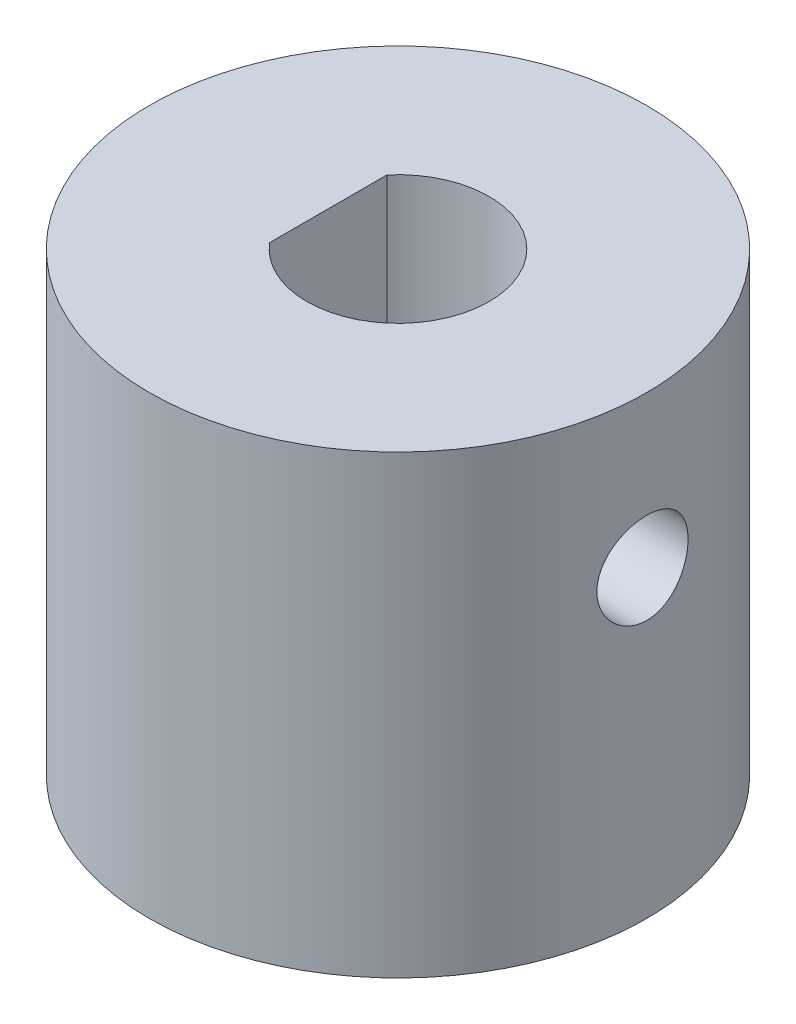
ISO-10303-21;
HEADER;
FILE_DESCRIPTION(('STEP AP214'),'2;1');
FILE_NAME('part.step','',(''),(''),'','','');
FILE_SCHEMA(('AUTOMOTIVE_DESIGN { 1 0 10303 214 1 1 1 1 }'));
ENDSEC;
DATA;
#1=APPLICATION_CONTEXT('core data for automotive mechanical design processes');
#2=APPLICATION_PROTOCOL_DEFINITION('international standard','automotive_design',2000,#1);
#3=PRODUCT_CONTEXT('',#1,'mechanical');
#4=PRODUCT('Part','Part','',(#3));
#5=PRODUCT_RELATED_PRODUCT_CATEGORY('part','',(#4));
#6=PRODUCT_DEFINITION_FORMATION('','',#4);
#7=PRODUCT_DEFINITION_CONTEXT('part definition',#1,'design');
#8=PRODUCT_DEFINITION('design','',#6,#7);
#9=PRODUCT_DEFINITION_SHAPE('','',#8);
#10=(LENGTH_UNIT() NAMED_UNIT(*) SI_UNIT(.MILLI.,.METRE.));
#11=(NAMED_UNIT(*) PLANE_ANGLE_UNIT() SI_UNIT($,.RADIAN.));
#12=(NAMED_UNIT(*) SI_UNIT($,.STERADIAN.) SOLID_ANGLE_UNIT());
#13=UNCERTAINTY_MEASURE_WITH_UNIT(LENGTH_MEASURE(1.E-05),#10,'distance_accuracy_value','');
#14=(GEOMETRIC_REPRESENTATION_CONTEXT(3) GLOBAL_UNCERTAINTY_ASSIGNED_CONTEXT((#13)) GLOBAL_UNIT_ASSIGNED_CONTEXT((#10,
#11,#12)) REPRESENTATION_CONTEXT('',''));
#15=CARTESIAN_POINT('',(0.,0.,0.));
#16=DIRECTION('',(0.,0.,1.));
#17=DIRECTION('',(1.,0.,0.));
#18=AXIS2_PLACEMENT_3D('',#15,#16,#17);
#19=CARTESIAN_POINT('',(0.,15.,0.));
#20=DIRECTION('',(0.,-1.,0.));
#21=DIRECTION('',(0.,0.,-1.));
#22=AXIS2_PLACEMENT_3D('',#19,#20,#21);
#23=CYLINDRICAL_SURFACE('',#22,8.1890069126629);
#24=CARTESIAN_POINT('',(0.,15.,0.));
#25=DIRECTION('',(0.,1.,0.));
#26=DIRECTION('',(0.,0.,1.));
#27=AXIS2_PLACEMENT_3D('',#24,#25,#26);
#28=CIRCLE('',#27,8.1890069126629);
#29=CARTESIAN_POINT('',(0.,15.,8.1890069126629));
#30=VERTEX_POINT('',#29);
#31=EDGE_CURVE('E93',#30,#30,#28,.T.);
#32=ORIENTED_EDGE('',*,*,#31,.F.);
#33=EDGE_LOOP('',(#32));
#34=FACE_BOUND('',#33,.T.);
#35=CARTESIAN_POINT('',(0.,0.,0.));
#36=DIRECTION('',(0.,1.,0.));
#37=DIRECTION('',(0.,0.,1.));
#38=AXIS2_PLACEMENT_3D('',#35,#36,#37);
#39=CIRCLE('',#38,8.1890069126629);
#40=CARTESIAN_POINT('',(0.,0.,8.1890069126629));
#41=VERTEX_POINT('',#40);
#42=EDGE_CURVE('E97',#41,#41,#39,.T.);
#43=ORIENTED_EDGE('',*,*,#42,.T.);
#44=EDGE_LOOP('',(#43));
#45=FACE_BOUND('',#44,.T.);
#46=CARTESIAN_POINT('',(-8.05045552845556,10.,1.5));
#47=CARTESIAN_POINT('',(-8.05045712508259,10.0834938156143,1.4999967617717));
#48=CARTESIAN_POINT('',(-8.05176853870894,10.1670300636327,1.49300513990406));
#49=CARTESIAN_POINT('',(-8.05686634931734,10.3317495697272,1.4652407751053));
#50=CARTESIAN_POINT('',(-8.06065488543688,10.4129307307125,1.44445612086685));
#51=CARTESIAN_POINT('',(-8.07026379045823,10.5705327738723,1.38976326790009));
#52=CARTESIAN_POINT('',(-8.07608230855931,10.6469579177234,1.3558670203884));
#53=CARTESIAN_POINT('',(-8.08909338794624,10.7930311217619,1.27594444054268));
#54=CARTESIAN_POINT('',(-8.09628583178107,10.862679760476,1.22991914494129));
#55=CARTESIAN_POINT('',(-8.11132982233989,10.9940563428632,1.12646193963049));
#56=CARTESIAN_POINT('',(-8.11918757044286,11.0556920738239,1.06891381680938));
#57=CARTESIAN_POINT('',(-8.13462196064732,11.1684903395025,0.944295708381802));
#58=CARTESIAN_POINT('',(-8.14219858466923,11.2196522015802,0.877225111702609));
#59=CARTESIAN_POINT('',(-8.15628331442015,11.3104022557995,0.734861982440969));
#60=CARTESIAN_POINT('',(-8.1627832648426,11.3499037419658,0.659513302848179));
#61=CARTESIAN_POINT('',(-8.17391295020838,11.4156534094499,0.503110300253054));
#62=CARTESIAN_POINT('',(-8.17854283188648,11.4419026306458,0.422056425494574));
#63=CARTESIAN_POINT('',(-8.18536692056306,11.4801181605587,0.257498859928041));
#64=CARTESIAN_POINT('',(-8.18758760043035,11.4922398184696,0.174032362073648));
#65=CARTESIAN_POINT('',(-8.18943425788382,11.5023399658799,0.00622277752115392));
#66=CARTESIAN_POINT('',(-8.18906044675426,11.5003196070446,-0.0781202372386156));
#67=CARTESIAN_POINT('',(-8.18578098641724,11.4823126494839,-0.244223994695152));
#68=CARTESIAN_POINT('',(-8.18290565840816,11.4664933039704,-0.326003553901674));
#69=CARTESIAN_POINT('',(-8.1749801954825,11.4216016988468,-0.485727469751368));
#70=CARTESIAN_POINT('',(-8.1699299840118,11.3925289727264,-0.563671691286158));
#71=CARTESIAN_POINT('',(-8.15817130484192,11.3217950337718,-0.714000173868228));
#72=CARTESIAN_POINT('',(-8.15145400709458,11.2800665169073,-0.786352047526514));
#73=CARTESIAN_POINT('',(-8.13710477696812,11.1852550435009,-0.92308926590461));
#74=CARTESIAN_POINT('',(-8.12947275569904,11.1321709830689,-0.987473835149091));
#75=CARTESIAN_POINT('',(-8.11400831391879,11.0152323038722,-1.10743919023639));
#76=CARTESIAN_POINT('',(-8.10617459531773,10.9512313868407,-1.16287729522729));
#77=CARTESIAN_POINT('',(-8.09129673862161,10.8147642945198,-1.26225347514702));
#78=CARTESIAN_POINT('',(-8.08425261106319,10.7422980062913,-1.30619139662293));
#79=CARTESIAN_POINT('',(-8.07174985721038,10.5907732147081,-1.38135788366982));
#80=CARTESIAN_POINT('',(-8.06629372476261,10.5117045906958,-1.41256648916948));
#81=CARTESIAN_POINT('',(-8.05762351420779,10.3493240106681,-1.4612166877625));
#82=CARTESIAN_POINT('',(-8.05440919452616,10.2660125128973,-1.47865976423639));
#83=CARTESIAN_POINT('',(-8.05063412373908,10.0987955403852,-1.49907705454895));
#84=CARTESIAN_POINT('',(-8.05003584479144,10.0149158744904,-1.50225591017226));
#85=CARTESIAN_POINT('',(-8.0514602723565,9.84782405234228,-1.49460239017643));
#86=CARTESIAN_POINT('',(-8.05348285547777,9.76461186484947,-1.48377067418173));
#87=CARTESIAN_POINT('',(-8.05988621764376,9.6018849099344,-1.44857890809767));
#88=CARTESIAN_POINT('',(-8.06424840605489,9.52234629139992,-1.42432546016269));
#89=CARTESIAN_POINT('',(-8.07482354515098,9.36846185147444,-1.36309152053184));
#90=CARTESIAN_POINT('',(-8.08103662677984,9.29411639794035,-1.32611012835186));
#91=CARTESIAN_POINT('',(-8.09469933246159,9.15182513329184,-1.23999647745459));
#92=CARTESIAN_POINT('',(-8.10216185476365,9.08395906542541,-1.19073453844537));
#93=CARTESIAN_POINT('',(-8.11744601502593,8.9573825709202,-1.08163370078843));
#94=CARTESIAN_POINT('',(-8.12526768369476,8.89867292909013,-1.02179389643542));
#95=CARTESIAN_POINT('',(-8.14050901925255,8.79131505337386,-0.892323545165101));
#96=CARTESIAN_POINT('',(-8.14792231223957,8.74280420177201,-0.82257821208514));
#97=CARTESIAN_POINT('',(-8.16140549390728,8.65818894498983,-0.675808712874689));
#98=CARTESIAN_POINT('',(-8.16747543262113,8.6220840777215,-0.598784817986429));
#99=CARTESIAN_POINT('',(-8.17756051384598,8.56351310808339,-0.440030368578519));
#100=CARTESIAN_POINT('',(-8.18158594842773,8.54097858360982,-0.358325740104583));
#101=CARTESIAN_POINT('',(-8.18717228596062,8.50996914963961,-0.192211023691789));
#102=CARTESIAN_POINT('',(-8.18873343588041,8.50149283123632,-0.1078012077299));
#103=CARTESIAN_POINT('',(-8.18921070214651,8.49888763365281,0.0600084943477198));
#104=CARTESIAN_POINT('',(-8.18816513168698,8.50455093419774,0.143405116693882));
#105=CARTESIAN_POINT('',(-8.18362574648551,8.52961028127592,0.308037353841498));
#106=CARTESIAN_POINT('',(-8.18013195294657,8.54900620887678,0.389272987352025));
#107=CARTESIAN_POINT('',(-8.17108830458502,8.60089430782467,0.547173994655788));
#108=CARTESIAN_POINT('',(-8.16554177372683,8.63336531434847,0.623846525686287));
#109=CARTESIAN_POINT('',(-8.152994157933,8.71045734078772,0.770686339753858));
#110=CARTESIAN_POINT('',(-8.14599298155967,8.7550791245448,0.840853213450022));
#111=CARTESIAN_POINT('',(-8.13118836753238,8.85592608897363,0.973728060142117));
#112=CARTESIAN_POINT('',(-8.12337525222211,8.9123018734933,1.03632066539604));
#113=CARTESIAN_POINT('',(-8.10788967358951,9.03474312816406,1.15122951116567));
#114=CARTESIAN_POINT('',(-8.10021724372751,9.10081087064608,1.20354333501936));
#115=CARTESIAN_POINT('',(-8.08580843580313,9.24145250558995,1.29683860628769));
#116=CARTESIAN_POINT('',(-8.07908085142835,9.31609587712226,1.3377167091771));
#117=CARTESIAN_POINT('',(-8.06742879793818,9.47128836314181,1.40628821789744));
#118=CARTESIAN_POINT('',(-8.06250260612163,9.55183174638424,1.43399422806801));
#119=CARTESIAN_POINT('',(-8.05605259568235,9.69385848886497,1.46971966709668));
#120=CARTESIAN_POINT('',(-8.05396598446343,9.75450374479107,1.48105560617139));
#121=CARTESIAN_POINT('',(-8.05116687877529,9.87675830959547,1.49619687346074));
#122=CARTESIAN_POINT('',(-8.05045434987767,9.93836759428051,1.50000239035429));
#123=CARTESIAN_POINT('',(-8.05045552845556,10.,1.5));
#124=B_SPLINE_CURVE_WITH_KNOTS('',3,(#46,#47,#48,#49,#50,#51,#52,#53,#54,#55,#56,#57,#58,#59,
#60,#61,#62,#63,#64,#65,#66,#67,#68,#69,#70,#71,#72,#73,#74,#75,#76,#77,#78,#79,#80,#81,#82,#83,
#84,#85,#86,#87,#88,#89,#90,#91,#92,#93,#94,#95,#96,#97,#98,#99,#100,#101,#102,#103,#104,#105,
#106,#107,#108,#109,#110,#111,#112,#113,#114,#115,#116,#117,#118,#119,#120,#121,#122,#123),
.UNSPECIFIED.,.T.,.F.,(4,2,2,2,2,2,2,2,2,2,2,2,2,2,2,2,2,2,2,2,2,2,2,2,2,2,2,2,2,2,2,2,2,2,2,2,
2,2,4),(0.,0.250255939526254,0.50072827535663,0.750972841613708,1.00119602510382,
1.25408295696729,1.50698612434019,1.76172505069723,2.01644398510422,2.26833473926557,
2.52020498076042,2.76906414838135,3.01793207635834,3.26814741839374,3.51838709531706,
3.7722901393315,4.0261965711333,4.2804996216943,4.53477526468337,4.78539102867204,
5.03599499397952,5.28463652500906,5.53329565069387,5.78470089623965,6.03612767821494,
6.29075047743675,6.54536379164738,6.79868234811987,7.05197551559413,7.30156782780784,
7.55115797843633,7.80034572758294,8.04954914518698,8.3021669466382,8.55484407061273,
8.80973585232632,9.06438323541326,9.24911861914775,9.43384937417561),.UNSPECIFIED.);
#125=CARTESIAN_POINT('',(-8.05045552845556,10.,1.5));
#126=VERTEX_POINT('',#125);
#127=EDGE_CURVE('E90',#126,#126,#124,.T.);
#128=ORIENTED_EDGE('',*,*,#127,.F.);
#129=EDGE_LOOP('',(#128));
#130=FACE_BOUND('',#129,.T.);
#131=CARTESIAN_POINT('',(8.05045552845556,10.,1.5));
#132=CARTESIAN_POINT('',(8.05045712508259,9.91650618438566,1.4999967617717));
#133=CARTESIAN_POINT('',(8.05176853870894,9.83296993636729,1.49300513990406));
#134=CARTESIAN_POINT('',(8.05686634931734,9.66825043027278,1.4652407751053));
#135=CARTESIAN_POINT('',(8.06065488543688,9.58706926928753,1.44445612086685));
#136=CARTESIAN_POINT('',(8.07026379045823,9.42946722612767,1.38976326790009));
#137=CARTESIAN_POINT('',(8.07608230855931,9.35304208227659,1.3558670203884));
#138=CARTESIAN_POINT('',(8.08909338794624,9.20696887823813,1.27594444054268));
#139=CARTESIAN_POINT('',(8.09628583178107,9.13732023952405,1.22991914494129));
#140=CARTESIAN_POINT('',(8.11132982233989,9.00594365713682,1.12646193963049));
#141=CARTESIAN_POINT('',(8.11918757044286,8.9443079261761,1.06891381680938));
#142=CARTESIAN_POINT('',(8.13462196064732,8.83150966049749,0.944295708381802));
#143=CARTESIAN_POINT('',(8.14219858466923,8.78034779841981,0.877225111702609));
#144=CARTESIAN_POINT('',(8.15628331442015,8.68959774420046,0.734861982440969));
#145=CARTESIAN_POINT('',(8.1627832648426,8.65009625803424,0.659513302848179));
#146=CARTESIAN_POINT('',(8.17391295020838,8.58434659055014,0.503110300253054));
#147=CARTESIAN_POINT('',(8.17854283188648,8.55809736935417,0.422056425494574));
#148=CARTESIAN_POINT('',(8.18536692056306,8.51988183944131,0.257498859928041));
#149=CARTESIAN_POINT('',(8.18758760043035,8.50776018153036,0.174032362073648));
#150=CARTESIAN_POINT('',(8.18943425788382,8.49766003412006,0.00622277752115386));
#151=CARTESIAN_POINT('',(8.18906044675426,8.49968039295538,-0.0781202372386156));
#152=CARTESIAN_POINT('',(8.18578098641724,8.51768735051606,-0.244223994695152));
#153=CARTESIAN_POINT('',(8.18290565840816,8.53350669602961,-0.326003553901674));
#154=CARTESIAN_POINT('',(8.1749801954825,8.57839830115321,-0.485727469751368));
#155=CARTESIAN_POINT('',(8.1699299840118,8.60747102727357,-0.563671691286158));
#156=CARTESIAN_POINT('',(8.15817130484192,8.67820496622819,-0.714000173868228));
#157=CARTESIAN_POINT('',(8.15145400709458,8.71993348309274,-0.786352047526514));
#158=CARTESIAN_POINT('',(8.13710477696812,8.81474495649912,-0.92308926590461));
#159=CARTESIAN_POINT('',(8.12947275569904,8.86782901693111,-0.987473835149091));
#160=CARTESIAN_POINT('',(8.11400831391879,8.9847676961278,-1.10743919023639));
#161=CARTESIAN_POINT('',(8.10617459531773,9.04876861315934,-1.16287729522729));
#162=CARTESIAN_POINT('',(8.09129673862161,9.1852357054802,-1.26225347514702));
#163=CARTESIAN_POINT('',(8.08425261106319,9.25770199370869,-1.30619139662293));
#164=CARTESIAN_POINT('',(8.07174985721038,9.40922678529189,-1.38135788366982));
#165=CARTESIAN_POINT('',(8.06629372476261,9.48829540930421,-1.41256648916948));
#166=CARTESIAN_POINT('',(8.05762351420779,9.65067598933187,-1.4612166877625));
#167=CARTESIAN_POINT('',(8.05440919452616,9.73398748710267,-1.47865976423639));
#168=CARTESIAN_POINT('',(8.05063412373908,9.90120445961476,-1.49907705454895));
#169=CARTESIAN_POINT('',(8.05003584479144,9.98508412550964,-1.50225591017226));
#170=CARTESIAN_POINT('',(8.0514602723565,10.1521759476577,-1.49460239017643));
#171=CARTESIAN_POINT('',(8.05348285547777,10.2353881351505,-1.48377067418173));
#172=CARTESIAN_POINT('',(8.05988621764376,10.3981150900656,-1.44857890809767));
#173=CARTESIAN_POINT('',(8.06424840605489,10.4776537086001,-1.42432546016269));
#174=CARTESIAN_POINT('',(8.07482354515098,10.6315381485256,-1.36309152053184));
#175=CARTESIAN_POINT('',(8.08103662677984,10.7058836020597,-1.32611012835186));
#176=CARTESIAN_POINT('',(8.09469933246159,10.8481748667082,-1.23999647745459));
#177=CARTESIAN_POINT('',(8.10216185476365,10.9160409345746,-1.19073453844537));
#178=CARTESIAN_POINT('',(8.11744601502593,11.0426174290798,-1.08163370078843));
#179=CARTESIAN_POINT('',(8.12526768369476,11.1013270709099,-1.02179389643542));
#180=CARTESIAN_POINT('',(8.14050901925255,11.2086849466261,-0.892323545165101));
#181=CARTESIAN_POINT('',(8.14792231223957,11.257195798228,-0.82257821208514));
#182=CARTESIAN_POINT('',(8.16140549390728,11.3418110550102,-0.675808712874689));
#183=CARTESIAN_POINT('',(8.16747543262113,11.3779159222785,-0.598784817986429));
#184=CARTESIAN_POINT('',(8.17756051384598,11.4364868919166,-0.440030368578519));
#185=CARTESIAN_POINT('',(8.18158594842773,11.4590214163902,-0.358325740104583));
#186=CARTESIAN_POINT('',(8.18717228596062,11.4900308503604,-0.192211023691788));
#187=CARTESIAN_POINT('',(8.18873343588041,11.4985071687637,-0.1078012077299));
#188=CARTESIAN_POINT('',(8.18921070214651,11.5011123663472,0.0600084943477198));
#189=CARTESIAN_POINT('',(8.18816513168698,11.4954490658023,0.143405116693882));
#190=CARTESIAN_POINT('',(8.18362574648551,11.4703897187241,0.308037353841498));
#191=CARTESIAN_POINT('',(8.18013195294657,11.4509937911232,0.389272987352025));
#192=CARTESIAN_POINT('',(8.17108830458502,11.3991056921753,0.547173994655788));
#193=CARTESIAN_POINT('',(8.16554177372683,11.3666346856515,0.623846525686287));
#194=CARTESIAN_POINT('',(8.152994157933,11.2895426592123,0.770686339753858));
#195=CARTESIAN_POINT('',(8.14599298155967,11.2449208754552,0.840853213450022));
#196=CARTESIAN_POINT('',(8.13118836753238,11.1440739110264,0.973728060142117));
#197=CARTESIAN_POINT('',(8.12337525222211,11.0876981265067,1.03632066539604));
#198=CARTESIAN_POINT('',(8.10788967358951,10.9652568718359,1.15122951116567));
#199=CARTESIAN_POINT('',(8.10021724372751,10.8991891293539,1.20354333501936));
#200=CARTESIAN_POINT('',(8.08580843580313,10.75854749441,1.29683860628769));
#201=CARTESIAN_POINT('',(8.07908085142835,10.6839041228777,1.3377167091771));
#202=CARTESIAN_POINT('',(8.06742879793818,10.5287116368582,1.40628821789744));
#203=CARTESIAN_POINT('',(8.06250260612163,10.4481682536158,1.43399422806801));
#204=CARTESIAN_POINT('',(8.05605259568235,10.306141511135,1.46971966709668));
#205=CARTESIAN_POINT('',(8.05396598446343,10.2454962552089,1.48105560617139));
#206=CARTESIAN_POINT('',(8.05116687877529,10.1232416904045,1.49619687346074));
#207=CARTESIAN_POINT('',(8.05045434987767,10.0616324057195,1.50000239035429));
#208=CARTESIAN_POINT('',(8.05045552845556,10.,1.5));
#209=B_SPLINE_CURVE_WITH_KNOTS('',3,(#131,#132,#133,#134,#135,#136,#137,#138,#139,#140,#141,
#142,#143,#144,#145,#146,#147,#148,#149,#150,#151,#152,#153,#154,#155,#156,#157,#158,#159,#160,
#161,#162,#163,#164,#165,#166,#167,#168,#169,#170,#171,#172,#173,#174,#175,#176,#177,#178,#179,
#180,#181,#182,#183,#184,#185,#186,#187,#188,#189,#190,#191,#192,#193,#194,#195,#196,#197,#198,
#199,#200,#201,#202,#203,#204,#205,#206,#207,#208),.UNSPECIFIED.,.T.,.F.,(4,2,2,2,2,2,2,2,2,2,2,
2,2,2,2,2,2,2,2,2,2,2,2,2,2,2,2,2,2,2,2,2,2,2,2,2,2,2,4),(0.,0.250255939526254,0.50072827535663,
0.75097284161371,1.00119602510382,1.25408295696729,1.50698612434019,1.76172505069723,
2.01644398510422,2.26833473926557,2.52020498076042,2.76906414838135,3.01793207635834,
3.26814741839374,3.51838709531706,3.7722901393315,4.0261965711333,4.28049962169429,
4.53477526468337,4.78539102867204,5.03599499397952,5.28463652500906,5.53329565069387,
5.78470089623965,6.03612767821494,6.29075047743675,6.54536379164738,6.79868234811987,
7.05197551559413,7.30156782780784,7.55115797843633,7.80034572758294,8.04954914518698,
8.3021669466382,8.55484407061273,8.80973585232632,9.06438323541326,9.24911861914775,
9.43384937417561),.UNSPECIFIED.);
#210=CARTESIAN_POINT('',(8.05045552845556,10.,1.5));
#211=VERTEX_POINT('',#210);
#212=EDGE_CURVE('E84',#211,#211,#209,.T.);
#213=ORIENTED_EDGE('',*,*,#212,.F.);
#214=EDGE_LOOP('',(#213));
#215=FACE_BOUND('',#214,.T.);
#216=ADVANCED_FACE('F39',(#34,#45,#130,#215),#23,.T.);
#217=CARTESIAN_POINT('',(0.,-15.,0.));
#218=DIRECTION('',(0.,1.,0.));
#219=DIRECTION('',(0.,0.,1.));
#220=AXIS2_PLACEMENT_3D('',#217,#218,#219);
#221=CYLINDRICAL_SURFACE('',#220,3.);
#222=CARTESIAN_POINT('',(0.,15.,0.));
#223=DIRECTION('',(0.,1.,0.));
#224=DIRECTION('',(0.,0.,1.));
#225=AXIS2_PLACEMENT_3D('',#222,#223,#224);
#226=CIRCLE('',#225,3.);
#227=CARTESIAN_POINT('',(-2.2951076558143,15.,1.93196295208335));
#228=VERTEX_POINT('',#227);
#229=CARTESIAN_POINT('',(-2.2951076558143,15.,-1.93196295208335));
#230=VERTEX_POINT('',#229);
#231=EDGE_CURVE('E65',#228,#230,#226,.T.);
#232=ORIENTED_EDGE('',*,*,#231,.T.);
#233=DIRECTION('',(0.,1.,0.));
#234=VECTOR('',#233,1.);
#235=CARTESIAN_POINT('',(-2.2951076558143,-15.,-1.93196295208335));
#236=LINE('',#235,#234);
#237=CARTESIAN_POINT('',(-2.2951076558143,5.,-1.93196295208335));
#238=VERTEX_POINT('',#237);
#239=EDGE_CURVE('E11',#230,#238,#236,.F.);
#240=ORIENTED_EDGE('',*,*,#239,.T.);
#241=CARTESIAN_POINT('',(0.,5.,0.));
#242=DIRECTION('',(0.,1.,0.));
#243=DIRECTION('',(0.,0.,1.));
#244=AXIS2_PLACEMENT_3D('',#241,#242,#243);
#245=CIRCLE('',#244,3.);
#246=CARTESIAN_POINT('',(-2.2951076558143,5.,1.93196295208335));
#247=VERTEX_POINT('',#246);
#248=EDGE_CURVE('E49',#247,#238,#245,.F.);
#249=ORIENTED_EDGE('',*,*,#248,.F.);
#250=DIRECTION('',(0.,1.,0.));
#251=VECTOR('',#250,1.);
#252=CARTESIAN_POINT('',(-2.2951076558143,5.,1.93196295208335));
#253=LINE('',#252,#251);
#254=EDGE_CURVE('E72',#247,#228,#253,.T.);
#255=ORIENTED_EDGE('',*,*,#254,.T.);
#256=EDGE_LOOP('',(#232,#240,#249,#255));
#257=FACE_BOUND('',#256,.T.);
#258=CARTESIAN_POINT('',(0.,0.,0.));
#259=DIRECTION('',(0.,1.,0.));
#260=DIRECTION('',(0.,0.,1.));
#261=AXIS2_PLACEMENT_3D('',#258,#259,#260);
#262=CIRCLE('',#261,3.);
#263=CARTESIAN_POINT('',(0.,0.,3.));
#264=VERTEX_POINT('',#263);
#265=EDGE_CURVE('E71',#264,#264,#262,.T.);
#266=ORIENTED_EDGE('',*,*,#265,.F.);
#267=EDGE_LOOP('',(#266));
#268=FACE_BOUND('',#267,.T.);
#269=CARTESIAN_POINT('',(2.59807621135332,10.,1.5));
#270=CARTESIAN_POINT('',(2.59808302092689,10.0781617122929,1.4999945446118));
#271=CARTESIAN_POINT('',(2.60165701781635,10.1564221172876,1.49384995609983));
#272=CARTESIAN_POINT('',(2.61543549678079,10.3105408970157,1.46958481484708));
#273=CARTESIAN_POINT('',(2.62565391083339,10.3863938725651,1.45143909683127));
#274=CARTESIAN_POINT('',(2.65124019908098,10.5331774965159,1.40414992304972));
#275=CARTESIAN_POINT('',(2.66658065209878,10.6041319787104,1.3750649287406));
#276=CARTESIAN_POINT('',(2.70063997225287,10.7401363029951,1.30690128806456));
#277=CARTESIAN_POINT('',(2.71935902214097,10.8051858253937,1.26782210105366));
#278=CARTESIAN_POINT('',(2.75995303586162,10.9334585928363,1.17699981079632));
#279=CARTESIAN_POINT('',(2.7819609545693,10.9960887035103,1.12447805421566));
#280=CARTESIAN_POINT('',(2.82557974178559,11.1121125826101,1.0098807114217));
#281=CARTESIAN_POINT('',(2.84719040746875,11.1655017438753,0.94780038867344));
#282=CARTESIAN_POINT('',(2.88932215429424,11.2650507267215,0.81073434512182));
#283=CARTESIAN_POINT('',(2.90967159627259,11.3104806517893,0.735160783518863));
#284=CARTESIAN_POINT('',(2.94526134149294,11.3877112798686,0.576235539899257));
#285=CARTESIAN_POINT('',(2.96050486775612,11.4195205842058,0.492888807207234));
#286=CARTESIAN_POINT('',(2.98320691866356,11.4662569919516,0.327067415888967));
#287=CARTESIAN_POINT('',(2.99114220331338,11.4822242895333,0.244952685733227));
#288=CARTESIAN_POINT('',(3.00011375769101,11.5002491780126,0.078855943046773));
#289=CARTESIAN_POINT('',(3.00115420176885,11.5023151851936,-0.00512490876560689));
#290=CARTESIAN_POINT('',(2.99644472874675,11.4928799890445,-0.164748786635624));
#291=CARTESIAN_POINT('',(2.99127743838241,11.4825429767182,-0.240481798765186));
#292=CARTESIAN_POINT('',(2.97561367889621,11.450678734143,-0.388970657877482));
#293=CARTESIAN_POINT('',(2.96511681099591,11.4291506665357,-0.461726281640887));
#294=CARTESIAN_POINT('',(2.93957374931482,11.3753761508653,-0.60346408735433));
#295=CARTESIAN_POINT('',(2.92446662293799,11.3429855302419,-0.672380135272767));
#296=CARTESIAN_POINT('',(2.89106468980031,11.2686048756978,-0.803965202269992));
#297=CARTESIAN_POINT('',(2.87276874236226,11.2266114050465,-0.866631973257968));
#298=CARTESIAN_POINT('',(2.83266591598844,11.1296569727005,-0.990260491347291));
#299=CARTESIAN_POINT('',(2.81069063997263,11.073845457511,-1.05050111254404));
#300=CARTESIAN_POINT('',(2.76681510880218,10.9531154126047,-1.16115655544667));
#301=CARTESIAN_POINT('',(2.74491492398443,10.8881899415889,-1.21156381736135));
#302=CARTESIAN_POINT('',(2.70216234138727,10.7460277113639,-1.30425800196332));
#303=CARTESIAN_POINT('',(2.68146479986061,10.6682709654187,-1.34582597246708));
#304=CARTESIAN_POINT('',(2.64563175417864,10.5055934929615,-1.41497866950185));
#305=CARTESIAN_POINT('',(2.63049045069101,10.4206803504737,-1.44257798731633));
#306=CARTESIAN_POINT('',(2.60916953725552,10.2531782330758,-1.48077031653756));
#307=CARTESIAN_POINT('',(2.60237483772745,10.1709383214347,-1.49253768317996));
#308=CARTESIAN_POINT('',(2.59676879042414,10.0053979877252,-1.50227541991714));
#309=CARTESIAN_POINT('',(2.59795180333967,9.92209835632032,-1.50025553597254));
#310=CARTESIAN_POINT('',(2.60751504810877,9.76651912213191,-1.48355406501595));
#311=CARTESIAN_POINT('',(2.61509381259981,9.69403082333811,-1.4702817250687));
#312=CARTESIAN_POINT('',(2.63541032327012,9.55244832059357,-1.43354442694866));
#313=CARTESIAN_POINT('',(2.64814974007551,9.48335522388009,-1.41007616793542));
#314=CARTESIAN_POINT('',(2.67804333119485,9.34688300364596,-1.35247138290733));
#315=CARTESIAN_POINT('',(2.69537464864595,9.27973147471967,-1.31789109553909));
#316=CARTESIAN_POINT('',(2.73234179245874,9.15179609269151,-1.23943059602371));
#317=CARTESIAN_POINT('',(2.75197880032721,9.09101553473008,-1.19554560649833));
#318=CARTESIAN_POINT('',(2.79431997684504,8.96953184871468,-1.09325575079828));
#319=CARTESIAN_POINT('',(2.81709874731434,8.90980427392351,-1.03371790847245));
#320=CARTESIAN_POINT('',(2.86101352466839,8.80088164300961,-0.905106743097434));
#321=CARTESIAN_POINT('',(2.88214897511564,8.75169014465419,-0.836030211983021));
#322=CARTESIAN_POINT('',(2.92112042536435,8.66413941107485,-0.687803043838137));
#323=CARTESIAN_POINT('',(2.93885462508044,8.62610032268363,-0.608434646361171));
#324=CARTESIAN_POINT('',(2.96825032438951,8.56429314421391,-0.443283546961624));
#325=CARTESIAN_POINT('',(2.9799171551456,8.54051252295054,-0.357506552088265));
#326=CARTESIAN_POINT('',(2.99501262272824,8.50994715373801,-0.190469523495626));
#327=CARTESIAN_POINT('',(2.99909891862287,8.50180318618583,-0.109517165775686));
#328=CARTESIAN_POINT('',(3.00063195562697,8.4987351018184,0.0526889789268045));
#329=CARTESIAN_POINT('',(2.99808102100335,8.50380635721466,0.133942650442629));
#330=CARTESIAN_POINT('',(2.98700953256884,8.52612461019343,0.28880698847572));
#331=CARTESIAN_POINT('',(2.97889342001985,8.54254727388651,0.362568476716895));
#332=CARTESIAN_POINT('',(2.95788140495135,8.58599049895446,0.506168928275426));
#333=CARTESIAN_POINT('',(2.94498481699193,8.61301258014018,0.576007327433263));
#334=CARTESIAN_POINT('',(2.9148889612218,8.67809057824896,0.713135109367327));
#335=CARTESIAN_POINT('',(2.89752925798199,8.71656898481176,0.780187714050069));
#336=CARTESIAN_POINT('',(2.86032199712739,8.80293689628857,0.907161962721037));
#337=CARTESIAN_POINT('',(2.84047329837541,8.85083072367351,0.96708031112236));
#338=CARTESIAN_POINT('',(2.79792915339941,8.96019570853405,1.08437100623534));
#339=CARTESIAN_POINT('',(2.77514698517547,9.02254373121579,1.14089652680891));
#340=CARTESIAN_POINT('',(2.73094614244278,9.15617608169465,1.24299493109201));
#341=CARTESIAN_POINT('',(2.70952868642798,9.22746823130153,1.28855812501509));
#342=CARTESIAN_POINT('',(2.66999407957374,9.37995496987143,1.36864661967848));
#343=CARTESIAN_POINT('',(2.65200261384405,9.4613912966931,1.40277759894141));
#344=CARTESIAN_POINT('',(2.62299234492527,9.62999860650966,1.45631806425962));
#345=CARTESIAN_POINT('',(2.61195024221553,9.71714933336903,1.47577678676302));
#346=CARTESIAN_POINT('',(2.60293908902686,9.83770803347799,1.49155051179662));
#347=CARTESIAN_POINT('',(2.60112193507728,9.87005184159682,1.49471415744578));
#348=CARTESIAN_POINT('',(2.59868903831625,9.93492472102336,1.49894010763495));
#349=CARTESIAN_POINT('',(2.59807337587664,9.96745380457881,1.50000227159981));
#350=CARTESIAN_POINT('',(2.59807621135332,10.,1.5));
#351=B_SPLINE_CURVE_WITH_KNOTS('',3,(#269,#270,#271,#272,#273,#274,#275,#276,#277,#278,#279,
#280,#281,#282,#283,#284,#285,#286,#287,#288,#289,#290,#291,#292,#293,#294,#295,#296,#297,#298,
#299,#300,#301,#302,#303,#304,#305,#306,#307,#308,#309,#310,#311,#312,#313,#314,#315,#316,#317,
#318,#319,#320,#321,#322,#323,#324,#325,#326,#327,#328,#329,#330,#331,#332,#333,#334,#335,#336,
#337,#338,#339,#340,#341,#342,#343,#344,#345,#346,#347,#348,#349,#350),.UNSPECIFIED.,.T.,.F.,(4,
2,2,2,2,2,2,2,2,2,2,2,2,2,2,2,2,2,2,2,2,2,2,2,2,2,2,2,2,2,2,2,2,2,2,2,2,2,2,2,4),(0.,
0.234348183892073,0.469189339237207,0.702792893878329,0.936409088167724,1.18929346874735,
1.44230356626557,1.71236838358145,1.98226240445837,2.23295227451903,2.4834903552906,
2.71224146226808,2.94100968776183,3.1729430209672,3.40495949025408,3.65890787185336,
3.91305072368878,4.18333262594173,4.45333161317557,4.70193436281318,4.9503613978256,
5.17161275136038,5.39293578654095,5.62450944609132,5.85620229330071,6.1171011537092,
6.37808797467304,6.64596272119449,6.91360169713158,7.15668405584231,7.39968130190958,
7.62666637307239,7.8536840026802,8.09041126079208,8.32724745151079,8.58765362775102,
8.84828914267732,9.11716123557908,9.38512699504141,9.48270202777964,9.58028358741811),.UNSPECIFIED.);
#352=CARTESIAN_POINT('',(2.59807621135332,10.,1.5));
#353=VERTEX_POINT('',#352);
#354=EDGE_CURVE('E144',#353,#353,#351,.T.);
#355=ORIENTED_EDGE('',*,*,#354,.F.);
#356=EDGE_LOOP('',(#355));
#357=FACE_BOUND('',#356,.T.);
#358=ADVANCED_FACE('F74',(#257,#268,#357),#221,.F.);
#359=CARTESIAN_POINT('',(0.,15.,0.));
#360=DIRECTION('',(0.,1.,0.));
#361=DIRECTION('',(0.,0.,1.));
#362=AXIS2_PLACEMENT_3D('',#359,#360,#361);
#363=PLANE('',#362);
#364=ORIENTED_EDGE('',*,*,#231,.F.);
#365=DIRECTION('',(0.,0.,-1.));
#366=VECTOR('',#365,1.);
#367=CARTESIAN_POINT('',(-2.2951076558143,15.,1.93196295208335));
#368=LINE('',#367,#366);
#369=EDGE_CURVE('E69',#228,#230,#368,.T.);
#370=ORIENTED_EDGE('',*,*,#369,.T.);
#371=EDGE_LOOP('',(#364,#370));
#372=FACE_BOUND('',#371,.T.);
#373=ORIENTED_EDGE('',*,*,#31,.T.);
#374=EDGE_LOOP('',(#373));
#375=FACE_BOUND('',#374,.T.);
#376=ADVANCED_FACE('F66',(#372,#375),#363,.T.);
#377=CARTESIAN_POINT('',(0.,0.,0.));
#378=DIRECTION('',(0.,1.,0.));
#379=DIRECTION('',(0.,0.,1.));
#380=AXIS2_PLACEMENT_3D('',#377,#378,#379);
#381=PLANE('',#380);
#382=ORIENTED_EDGE('',*,*,#265,.T.);
#383=EDGE_LOOP('',(#382));
#384=FACE_BOUND('',#383,.T.);
#385=ORIENTED_EDGE('',*,*,#42,.F.);
#386=EDGE_LOOP('',(#385));
#387=FACE_BOUND('',#386,.T.);
#388=ADVANCED_FACE('F117',(#384,#387),#381,.F.);
#389=CARTESIAN_POINT('',(-2.2951076558143,5.,1.93196295208335));
#390=DIRECTION('',(1.,0.,0.));
#391=DIRECTION('',(0.,0.,-1.));
#392=AXIS2_PLACEMENT_3D('',#389,#390,#391);
#393=PLANE('',#392);
#394=CARTESIAN_POINT('',(-2.2951076558143,10.,0.));
#395=DIRECTION('',(1.,0.,0.));
#396=DIRECTION('',(0.,0.,-1.));
#397=AXIS2_PLACEMENT_3D('',#394,#395,#396);
#398=CIRCLE('',#397,1.5);
#399=CARTESIAN_POINT('',(-2.2951076558143,10.,-1.5));
#400=VERTEX_POINT('',#399);
#401=EDGE_CURVE('E43',#400,#400,#398,.F.);
#402=ORIENTED_EDGE('',*,*,#401,.T.);
#403=EDGE_LOOP('',(#402));
#404=FACE_BOUND('',#403,.T.);
#405=ORIENTED_EDGE('',*,*,#239,.F.);
#406=ORIENTED_EDGE('',*,*,#369,.F.);
#407=ORIENTED_EDGE('',*,*,#254,.F.);
#408=DIRECTION('',(0.,0.,-1.));
#409=VECTOR('',#408,1.);
#410=CARTESIAN_POINT('',(-2.2951076558143,5.,1.93196295208335));
#411=LINE('',#410,#409);
#412=EDGE_CURVE('E80',#247,#238,#411,.T.);
#413=ORIENTED_EDGE('',*,*,#412,.T.);
#414=EDGE_LOOP('',(#405,#406,#407,#413));
#415=FACE_BOUND('',#414,.T.);
#416=ADVANCED_FACE('F82',(#404,#415),#393,.T.);
#417=CARTESIAN_POINT('',(0.,5.,0.));
#418=DIRECTION('',(0.,1.,0.));
#419=DIRECTION('',(0.,0.,1.));
#420=AXIS2_PLACEMENT_3D('',#417,#418,#419);
#421=PLANE('',#420);
#422=ORIENTED_EDGE('',*,*,#412,.F.);
#423=ORIENTED_EDGE('',*,*,#248,.T.);
#424=EDGE_LOOP('',(#422,#423));
#425=FACE_BOUND('',#424,.T.);
#426=ADVANCED_FACE('F106',(#425),#421,.F.);
#427=CARTESIAN_POINT('',(10.,10.,0.));
#428=DIRECTION('',(-1.,0.,0.));
#429=DIRECTION('',(0.,0.,1.));
#430=AXIS2_PLACEMENT_3D('',#427,#428,#429);
#431=CYLINDRICAL_SURFACE('',#430,1.5);
#432=ORIENTED_EDGE('',*,*,#401,.F.);
#433=EDGE_LOOP('',(#432));
#434=FACE_BOUND('',#433,.T.);
#435=ORIENTED_EDGE('',*,*,#127,.T.);
#436=EDGE_LOOP('',(#435));
#437=FACE_BOUND('',#436,.T.);
#438=ADVANCED_FACE('F108',(#434,#437),#431,.F.);
#439=ORIENTED_EDGE('',*,*,#354,.T.);
#440=EDGE_LOOP('',(#439));
#441=FACE_BOUND('',#440,.T.);
#442=ORIENTED_EDGE('',*,*,#212,.T.);
#443=EDGE_LOOP('',(#442));
#444=FACE_BOUND('',#443,.T.);
#445=ADVANCED_FACE('F114',(#441,#444),#431,.F.);
#446=CLOSED_SHELL('',(#216,#358,#376,#388,#416,#426,#438,#445));
#447=MANIFOLD_SOLID_BREP('B2',#446);
#448=ADVANCED_BREP_SHAPE_REPRESENTATION('',(#18,#447),#14);
#449=SHAPE_DEFINITION_REPRESENTATION(#9,#448);
ENDSEC;
END-ISO-10303-21;
